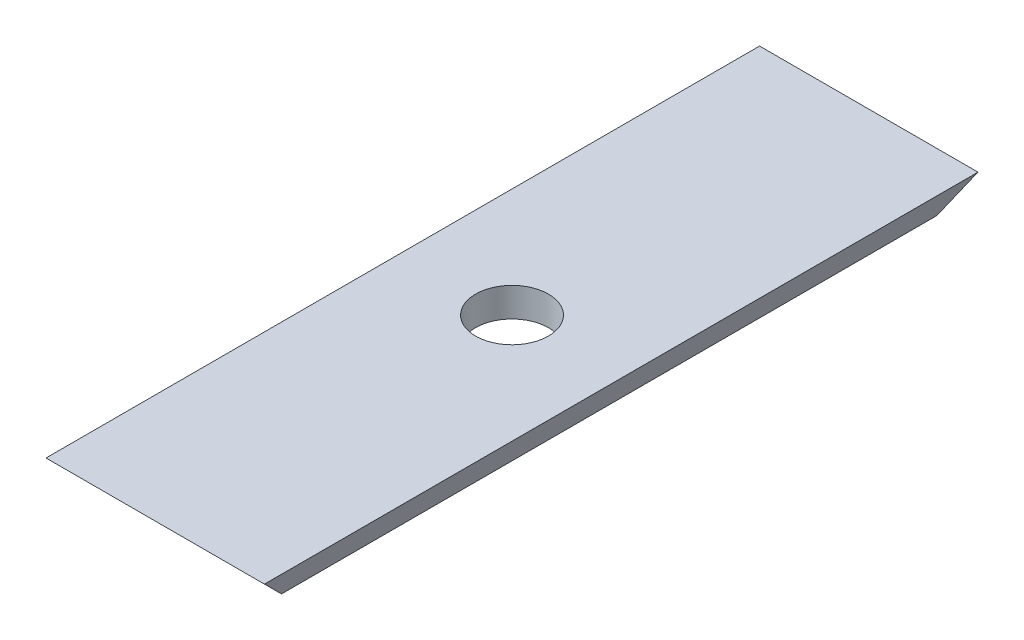
ISO-10303-21;
HEADER;
FILE_DESCRIPTION(('STEP AP214'),'2;1');
FILE_NAME('part.step','',(''),(''),'','','');
FILE_SCHEMA(('AUTOMOTIVE_DESIGN { 1 0 10303 214 1 1 1 1 }'));
ENDSEC;
DATA;
#1=APPLICATION_CONTEXT('core data for automotive mechanical design processes');
#2=APPLICATION_PROTOCOL_DEFINITION('international standard','automotive_design',2000,#1);
#3=PRODUCT_CONTEXT('',#1,'mechanical');
#4=PRODUCT('Part','Part','',(#3));
#5=PRODUCT_RELATED_PRODUCT_CATEGORY('part','',(#4));
#6=PRODUCT_DEFINITION_FORMATION('','',#4);
#7=PRODUCT_DEFINITION_CONTEXT('part definition',#1,'design');
#8=PRODUCT_DEFINITION('design','',#6,#7);
#9=PRODUCT_DEFINITION_SHAPE('','',#8);
#10=(LENGTH_UNIT() NAMED_UNIT(*) SI_UNIT(.MILLI.,.METRE.));
#11=(NAMED_UNIT(*) PLANE_ANGLE_UNIT() SI_UNIT($,.RADIAN.));
#12=(NAMED_UNIT(*) SI_UNIT($,.STERADIAN.) SOLID_ANGLE_UNIT());
#13=UNCERTAINTY_MEASURE_WITH_UNIT(LENGTH_MEASURE(1.E-05),#10,'distance_accuracy_value','');
#14=(GEOMETRIC_REPRESENTATION_CONTEXT(3) GLOBAL_UNCERTAINTY_ASSIGNED_CONTEXT((#13)) GLOBAL_UNIT_ASSIGNED_CONTEXT((#10,
#11,#12)) REPRESENTATION_CONTEXT('',''));
#15=CARTESIAN_POINT('',(0.,0.,0.));
#16=DIRECTION('',(0.,0.,1.));
#17=DIRECTION('',(1.,0.,0.));
#18=AXIS2_PLACEMENT_3D('',#15,#16,#17);
#19=CARTESIAN_POINT('',(0.,0.,490.));
#20=DIRECTION('',(0.,1.,0.));
#21=DIRECTION('',(0.,0.,1.));
#22=AXIS2_PLACEMENT_3D('',#19,#20,#21);
#23=PLANE('',#22);
#24=CARTESIAN_POINT('',(75.,0.,245.));
#25=DIRECTION('',(0.,-1.,0.));
#26=DIRECTION('',(0.,0.,-1.));
#27=AXIS2_PLACEMENT_3D('',#24,#25,#26);
#28=CIRCLE('',#27,25.);
#29=CARTESIAN_POINT('',(75.,0.,220.));
#30=VERTEX_POINT('',#29);
#31=EDGE_CURVE('E129',#30,#30,#28,.T.);
#32=ORIENTED_EDGE('',*,*,#31,.F.);
#33=EDGE_LOOP('',(#32));
#34=FACE_BOUND('',#33,.T.);
#35=DIRECTION('',(1.,0.,0.));
#36=VECTOR('',#35,1.);
#37=CARTESIAN_POINT('',(150.,0.,20.0000000000001));
#38=LINE('',#37,#36);
#39=CARTESIAN_POINT('',(20.0000000000001,0.,20.0000000000001));
#40=VERTEX_POINT('',#39);
#41=CARTESIAN_POINT('',(141.715728752538,0.,20.0000000000001));
#42=VERTEX_POINT('',#41);
#43=EDGE_CURVE('E101',#40,#42,#38,.T.);
#44=ORIENTED_EDGE('',*,*,#43,.T.);
#45=DIRECTION('',(0.,0.,1.));
#46=VECTOR('',#45,1.);
#47=CARTESIAN_POINT('',(141.715728752538,0.,490.));
#48=LINE('',#47,#46);
#49=CARTESIAN_POINT('',(141.715728752538,0.,470.));
#50=VERTEX_POINT('',#49);
#51=EDGE_CURVE('E51',#42,#50,#48,.T.);
#52=ORIENTED_EDGE('',*,*,#51,.T.);
#53=DIRECTION('',(-1.,0.,0.));
#54=VECTOR('',#53,1.);
#55=CARTESIAN_POINT('',(0.,0.,470.));
#56=LINE('',#55,#54);
#57=CARTESIAN_POINT('',(20.0000000000001,0.,470.));
#58=VERTEX_POINT('',#57);
#59=EDGE_CURVE('E87',#50,#58,#56,.T.);
#60=ORIENTED_EDGE('',*,*,#59,.T.);
#61=DIRECTION('',(0.,0.,-1.));
#62=VECTOR('',#61,1.);
#63=CARTESIAN_POINT('',(20.0000000000001,0.,490.));
#64=LINE('',#63,#62);
#65=EDGE_CURVE('E105',#58,#40,#64,.T.);
#66=ORIENTED_EDGE('',*,*,#65,.T.);
#67=EDGE_LOOP('',(#44,#52,#60,#66));
#68=FACE_BOUND('',#67,.T.);
#69=ADVANCED_FACE('F41',(#34,#68),#23,.F.);
#70=CARTESIAN_POINT('',(0.,20.,490.));
#71=DIRECTION('',(0.,-1.,0.));
#72=DIRECTION('',(1.,0.,0.));
#73=AXIS2_PLACEMENT_3D('',#70,#71,#72);
#74=PLANE('',#73);
#75=CARTESIAN_POINT('',(75.,20.,245.));
#76=DIRECTION('',(0.,-1.,0.));
#77=DIRECTION('',(0.,0.,-1.));
#78=AXIS2_PLACEMENT_3D('',#75,#76,#77);
#79=CIRCLE('',#78,25.);
#80=CARTESIAN_POINT('',(75.,20.,220.));
#81=VERTEX_POINT('',#80);
#82=EDGE_CURVE('E118',#81,#81,#79,.T.);
#83=ORIENTED_EDGE('',*,*,#82,.T.);
#84=EDGE_LOOP('',(#83));
#85=FACE_BOUND('',#84,.T.);
#86=DIRECTION('',(-1.,0.,0.));
#87=VECTOR('',#86,1.);
#88=CARTESIAN_POINT('',(0.,20.,0.));
#89=LINE('',#88,#87);
#90=CARTESIAN_POINT('',(150.,20.,0.));
#91=VERTEX_POINT('',#90);
#92=CARTESIAN_POINT('',(0.,20.,0.));
#93=VERTEX_POINT('',#92);
#94=EDGE_CURVE('E98',#91,#93,#89,.T.);
#95=ORIENTED_EDGE('',*,*,#94,.T.);
#96=DIRECTION('',(0.,0.,-1.));
#97=VECTOR('',#96,1.);
#98=CARTESIAN_POINT('',(0.,20.,490.));
#99=LINE('',#98,#97);
#100=CARTESIAN_POINT('',(0.,20.,490.));
#101=VERTEX_POINT('',#100);
#102=EDGE_CURVE('E95',#101,#93,#99,.T.);
#103=ORIENTED_EDGE('',*,*,#102,.F.);
#104=DIRECTION('',(-1.,0.,0.));
#105=VECTOR('',#104,1.);
#106=CARTESIAN_POINT('',(0.,20.,490.));
#107=LINE('',#106,#105);
#108=CARTESIAN_POINT('',(150.,20.,490.));
#109=VERTEX_POINT('',#108);
#110=EDGE_CURVE('E86',#109,#101,#107,.T.);
#111=ORIENTED_EDGE('',*,*,#110,.F.);
#112=DIRECTION('',(0.,0.,-1.));
#113=VECTOR('',#112,1.);
#114=CARTESIAN_POINT('',(150.,20.,490.));
#115=LINE('',#114,#113);
#116=EDGE_CURVE('E93',#109,#91,#115,.T.);
#117=ORIENTED_EDGE('',*,*,#116,.T.);
#118=EDGE_LOOP('',(#95,#103,#111,#117));
#119=FACE_BOUND('',#118,.T.);
#120=ADVANCED_FACE('F92',(#85,#119),#74,.F.);
#121=CARTESIAN_POINT('',(0.,0.,20.0000000000001));
#122=DIRECTION('',(0.,-0.707106781186546,-0.707106781186548));
#123=DIRECTION('',(-1.,0.,0.));
#124=AXIS2_PLACEMENT_3D('',#121,#122,#123);
#125=PLANE('',#124);
#126=ORIENTED_EDGE('',*,*,#94,.F.);
#127=DIRECTION('',(0.281084637714819,0.678598344545848,-0.678598344545846));
#128=VECTOR('',#127,1.);
#129=CARTESIAN_POINT('',(130.518971172887,-27.0313640033964,47.0313640033964));
#130=LINE('',#129,#128);
#131=EDGE_CURVE('E65',#91,#42,#130,.F.);
#132=ORIENTED_EDGE('',*,*,#131,.T.);
#133=ORIENTED_EDGE('',*,*,#43,.F.);
#134=DIRECTION('',(0.577350269189625,-0.577350269189627,0.577350269189625));
#135=VECTOR('',#134,1.);
#136=CARTESIAN_POINT('',(13.3333333333334,6.6666666666667,13.3333333333334));
#137=LINE('',#136,#135);
#138=EDGE_CURVE('E117',#93,#40,#137,.T.);
#139=ORIENTED_EDGE('',*,*,#138,.F.);
#140=EDGE_LOOP('',(#126,#132,#133,#139));
#141=FACE_BOUND('',#140,.T.);
#142=ADVANCED_FACE('F146',(#141),#125,.T.);
#143=CARTESIAN_POINT('',(20.0000000000001,0.,490.));
#144=DIRECTION('',(0.707106781186548,0.707106781186546,0.));
#145=DIRECTION('',(0.,0.,-1.));
#146=AXIS2_PLACEMENT_3D('',#143,#144,#145);
#147=PLANE('',#146);
#148=ORIENTED_EDGE('',*,*,#138,.T.);
#149=ORIENTED_EDGE('',*,*,#65,.F.);
#150=DIRECTION('',(-0.577350269189625,0.577350269189627,0.577350269189625));
#151=VECTOR('',#150,1.);
#152=CARTESIAN_POINT('',(13.3333333333334,6.6666666666667,476.666666666667));
#153=LINE('',#152,#151);
#154=EDGE_CURVE('E114',#101,#58,#153,.F.);
#155=ORIENTED_EDGE('',*,*,#154,.F.);
#156=ORIENTED_EDGE('',*,*,#102,.T.);
#157=EDGE_LOOP('',(#148,#149,#155,#156));
#158=FACE_BOUND('',#157,.T.);
#159=ADVANCED_FACE('F147',(#158),#147,.F.);
#160=CARTESIAN_POINT('',(0.,20.0000000000001,490.));
#161=DIRECTION('',(0.,0.707106781186546,-0.707106781186548));
#162=DIRECTION('',(1.,0.,0.));
#163=AXIS2_PLACEMENT_3D('',#160,#161,#162);
#164=PLANE('',#163);
#165=ORIENTED_EDGE('',*,*,#59,.F.);
#166=DIRECTION('',(0.281084637714819,0.678598344545848,0.678598344545846));
#167=VECTOR('',#166,1.);
#168=CARTESIAN_POINT('',(138.148713966109,-8.6115354745817,461.388464525418));
#169=LINE('',#168,#167);
#170=EDGE_CURVE('E11',#50,#109,#169,.T.);
#171=ORIENTED_EDGE('',*,*,#170,.T.);
#172=ORIENTED_EDGE('',*,*,#110,.T.);
#173=ORIENTED_EDGE('',*,*,#154,.T.);
#174=EDGE_LOOP('',(#165,#171,#172,#173));
#175=FACE_BOUND('',#174,.T.);
#176=ADVANCED_FACE('F84',(#175),#164,.F.);
#177=CARTESIAN_POINT('',(75.,20.,245.));
#178=DIRECTION('',(0.,-1.,0.));
#179=DIRECTION('',(0.,0.,-1.));
#180=AXIS2_PLACEMENT_3D('',#177,#178,#179);
#181=CYLINDRICAL_SURFACE('',#180,25.);
#182=ORIENTED_EDGE('',*,*,#82,.F.);
#183=EDGE_LOOP('',(#182));
#184=FACE_BOUND('',#183,.T.);
#185=ORIENTED_EDGE('',*,*,#31,.T.);
#186=EDGE_LOOP('',(#185));
#187=FACE_BOUND('',#186,.T.);
#188=ADVANCED_FACE('F138',(#184,#187),#181,.F.);
#189=CARTESIAN_POINT('',(150.,20.0000000000002,490.));
#190=DIRECTION('',(-0.923879532511288,0.382683432365088,0.));
#191=DIRECTION('',(0.,0.,-1.));
#192=AXIS2_PLACEMENT_3D('',#189,#190,#191);
#193=PLANE('',#192);
#194=ORIENTED_EDGE('',*,*,#170,.F.);
#195=ORIENTED_EDGE('',*,*,#51,.F.);
#196=ORIENTED_EDGE('',*,*,#131,.F.);
#197=ORIENTED_EDGE('',*,*,#116,.F.);
#198=EDGE_LOOP('',(#194,#195,#196,#197));
#199=FACE_BOUND('',#198,.T.);
#200=ADVANCED_FACE('F44',(#199),#193,.F.);
#201=CLOSED_SHELL('',(#69,#120,#142,#159,#176,#188,#200));
#202=MANIFOLD_SOLID_BREP('B2',#201);
#203=ADVANCED_BREP_SHAPE_REPRESENTATION('',(#18,#202),#14);
#204=SHAPE_DEFINITION_REPRESENTATION(#9,#203);
ENDSEC;
END-ISO-10303-21;
